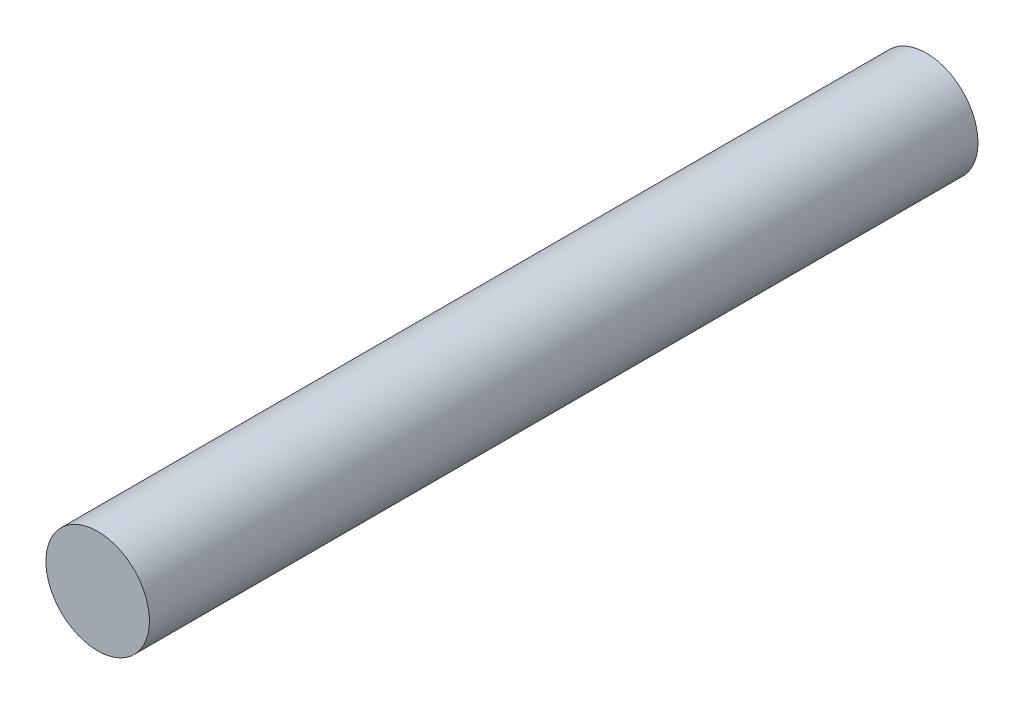
ISO-10303-21;
HEADER;
FILE_DESCRIPTION(('STEP AP214'),'2;1');
FILE_NAME('part.step','',(''),(''),'','','');
FILE_SCHEMA(('AUTOMOTIVE_DESIGN { 1 0 10303 214 1 1 1 1 }'));
ENDSEC;
DATA;
#1=APPLICATION_CONTEXT('core data for automotive mechanical design processes');
#2=APPLICATION_PROTOCOL_DEFINITION('international standard','automotive_design',2000,#1);
#3=PRODUCT_CONTEXT('',#1,'mechanical');
#4=PRODUCT('Part','Part','',(#3));
#5=PRODUCT_RELATED_PRODUCT_CATEGORY('part','',(#4));
#6=PRODUCT_DEFINITION_FORMATION('','',#4);
#7=PRODUCT_DEFINITION_CONTEXT('part definition',#1,'design');
#8=PRODUCT_DEFINITION('design','',#6,#7);
#9=PRODUCT_DEFINITION_SHAPE('','',#8);
#10=(LENGTH_UNIT() NAMED_UNIT(*) SI_UNIT(.MILLI.,.METRE.));
#11=(NAMED_UNIT(*) PLANE_ANGLE_UNIT() SI_UNIT($,.RADIAN.));
#12=(NAMED_UNIT(*) SI_UNIT($,.STERADIAN.) SOLID_ANGLE_UNIT());
#13=UNCERTAINTY_MEASURE_WITH_UNIT(LENGTH_MEASURE(1.E-05),#10,'distance_accuracy_value','');
#14=(GEOMETRIC_REPRESENTATION_CONTEXT(3) GLOBAL_UNCERTAINTY_ASSIGNED_CONTEXT((#13)) GLOBAL_UNIT_ASSIGNED_CONTEXT((#10,
#11,#12)) REPRESENTATION_CONTEXT('',''));
#15=CARTESIAN_POINT('',(0.,0.,0.));
#16=DIRECTION('',(0.,0.,1.));
#17=DIRECTION('',(1.,0.,0.));
#18=AXIS2_PLACEMENT_3D('',#15,#16,#17);
#19=CARTESIAN_POINT('',(0.,0.,30.));
#20=DIRECTION('',(0.,0.,-1.));
#21=DIRECTION('',(-1.,0.,0.));
#22=AXIS2_PLACEMENT_3D('',#19,#20,#21);
#23=CYLINDRICAL_SURFACE('',#22,1.875);
#24=CARTESIAN_POINT('',(0.,0.,30.));
#25=DIRECTION('',(0.,0.,1.));
#26=DIRECTION('',(1.,0.,0.));
#27=AXIS2_PLACEMENT_3D('',#24,#25,#26);
#28=CIRCLE('',#27,1.875);
#29=CARTESIAN_POINT('',(1.875,0.,30.));
#30=VERTEX_POINT('',#29);
#31=EDGE_CURVE('E10',#30,#30,#28,.T.);
#32=ORIENTED_EDGE('',*,*,#31,.F.);
#33=EDGE_LOOP('',(#32));
#34=FACE_BOUND('',#33,.T.);
#35=CARTESIAN_POINT('',(0.,0.,0.));
#36=DIRECTION('',(0.,0.,1.));
#37=DIRECTION('',(1.,0.,0.));
#38=AXIS2_PLACEMENT_3D('',#35,#36,#37);
#39=CIRCLE('',#38,1.875);
#40=CARTESIAN_POINT('',(1.875,0.,0.));
#41=VERTEX_POINT('',#40);
#42=EDGE_CURVE('E33',#41,#41,#39,.T.);
#43=ORIENTED_EDGE('',*,*,#42,.T.);
#44=EDGE_LOOP('',(#43));
#45=FACE_BOUND('',#44,.T.);
#46=ADVANCED_FACE('F30',(#34,#45),#23,.T.);
#47=CARTESIAN_POINT('',(0.,0.,30.));
#48=DIRECTION('',(0.,0.,1.));
#49=DIRECTION('',(1.,0.,0.));
#50=AXIS2_PLACEMENT_3D('',#47,#48,#49);
#51=PLANE('',#50);
#52=ORIENTED_EDGE('',*,*,#31,.T.);
#53=EDGE_LOOP('',(#52));
#54=FACE_BOUND('',#53,.T.);
#55=ADVANCED_FACE('F45',(#54),#51,.T.);
#56=CARTESIAN_POINT('',(0.,0.,0.));
#57=DIRECTION('',(0.,0.,1.));
#58=DIRECTION('',(1.,0.,0.));
#59=AXIS2_PLACEMENT_3D('',#56,#57,#58);
#60=PLANE('',#59);
#61=ORIENTED_EDGE('',*,*,#42,.F.);
#62=EDGE_LOOP('',(#61));
#63=FACE_BOUND('',#62,.T.);
#64=ADVANCED_FACE('F43',(#63),#60,.F.);
#65=CLOSED_SHELL('',(#46,#55,#64));
#66=MANIFOLD_SOLID_BREP('B2',#65);
#67=ADVANCED_BREP_SHAPE_REPRESENTATION('',(#18,#66),#14);
#68=SHAPE_DEFINITION_REPRESENTATION(#9,#67);
ENDSEC;
END-ISO-10303-21;
